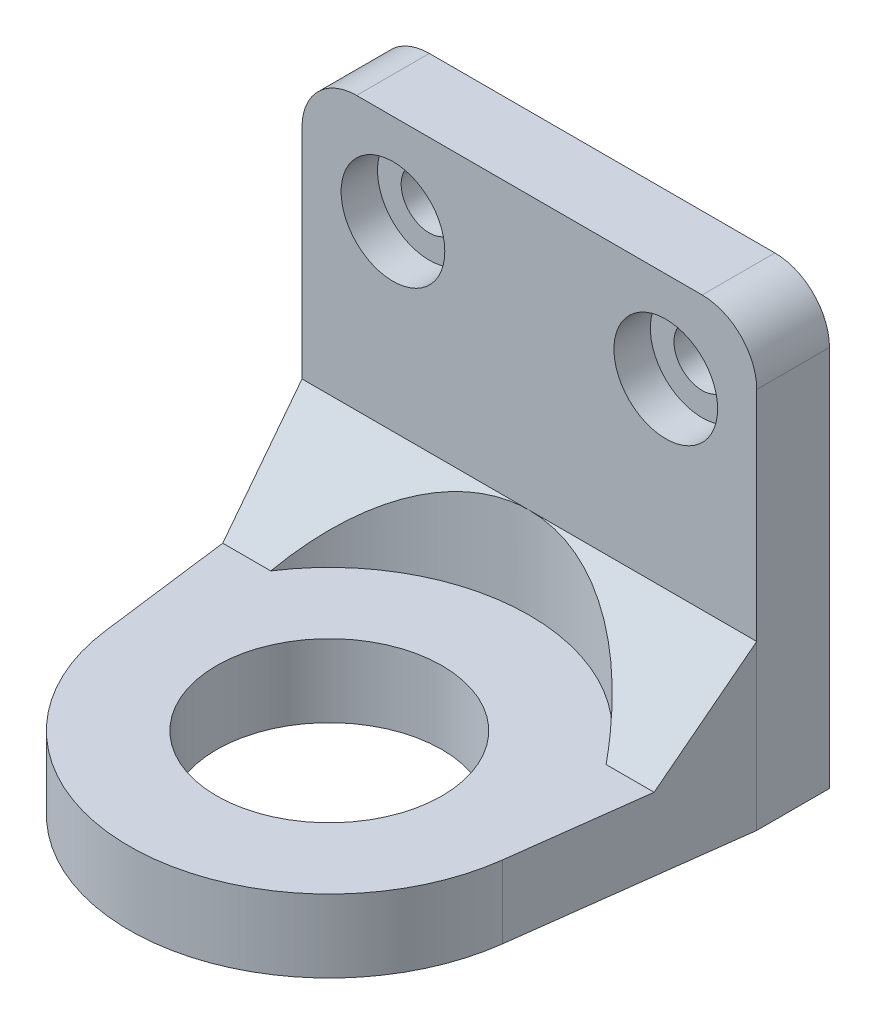
ISO-10303-21;
HEADER;
FILE_DESCRIPTION(('STEP AP214'),'2;1');
FILE_NAME('part.step','',(''),(''),'','','');
FILE_SCHEMA(('AUTOMOTIVE_DESIGN { 1 0 10303 214 1 1 1 1 }'));
ENDSEC;
DATA;
#1=APPLICATION_CONTEXT('core data for automotive mechanical design processes');
#2=APPLICATION_PROTOCOL_DEFINITION('international standard','automotive_design',2000,#1);
#3=PRODUCT_CONTEXT('',#1,'mechanical');
#4=PRODUCT('Part','Part','',(#3));
#5=PRODUCT_RELATED_PRODUCT_CATEGORY('part','',(#4));
#6=PRODUCT_DEFINITION_FORMATION('','',#4);
#7=PRODUCT_DEFINITION_CONTEXT('part definition',#1,'design');
#8=PRODUCT_DEFINITION('design','',#6,#7);
#9=PRODUCT_DEFINITION_SHAPE('','',#8);
#10=(LENGTH_UNIT() NAMED_UNIT(*) SI_UNIT(.MILLI.,.METRE.));
#11=(NAMED_UNIT(*) PLANE_ANGLE_UNIT() SI_UNIT($,.RADIAN.));
#12=(NAMED_UNIT(*) SI_UNIT($,.STERADIAN.) SOLID_ANGLE_UNIT());
#13=UNCERTAINTY_MEASURE_WITH_UNIT(LENGTH_MEASURE(1.E-05),#10,'distance_accuracy_value','');
#14=(GEOMETRIC_REPRESENTATION_CONTEXT(3) GLOBAL_UNCERTAINTY_ASSIGNED_CONTEXT((#13)) GLOBAL_UNIT_ASSIGNED_CONTEXT((#10,
#11,#12)) REPRESENTATION_CONTEXT('',''));
#15=CARTESIAN_POINT('',(0.,0.,0.));
#16=DIRECTION('',(0.,0.,1.));
#17=DIRECTION('',(1.,0.,0.));
#18=AXIS2_PLACEMENT_3D('',#15,#16,#17);
#19=CARTESIAN_POINT('',(5.,-30.5,4.));
#20=DIRECTION('',(0.,0.,-1.));
#21=DIRECTION('',(-1.,0.,0.));
#22=AXIS2_PLACEMENT_3D('',#19,#20,#21);
#23=CYLINDRICAL_SURFACE('',#22,1.55);
#24=CARTESIAN_POINT('',(5.,-30.5,0.));
#25=DIRECTION('',(0.,0.,1.));
#26=DIRECTION('',(1.,0.,0.));
#27=AXIS2_PLACEMENT_3D('',#24,#25,#26);
#28=CIRCLE('',#27,1.55);
#29=CARTESIAN_POINT('',(6.55,-30.5,0.));
#30=VERTEX_POINT('',#29);
#31=EDGE_CURVE('E234',#30,#30,#28,.T.);
#32=ORIENTED_EDGE('',*,*,#31,.F.);
#33=EDGE_LOOP('',(#32));
#34=FACE_BOUND('',#33,.T.);
#35=CARTESIAN_POINT('',(5.,-30.5,2.));
#36=DIRECTION('',(0.,0.,1.));
#37=DIRECTION('',(1.,0.,0.));
#38=AXIS2_PLACEMENT_3D('',#35,#36,#37);
#39=CIRCLE('',#38,1.55);
#40=CARTESIAN_POINT('',(6.55,-30.5,2.));
#41=VERTEX_POINT('',#40);
#42=EDGE_CURVE('E39',#41,#41,#39,.T.);
#43=ORIENTED_EDGE('',*,*,#42,.T.);
#44=EDGE_LOOP('',(#43));
#45=FACE_BOUND('',#44,.T.);
#46=ADVANCED_FACE('F35',(#34,#45),#23,.F.);
#47=CARTESIAN_POINT('',(20.,-30.5,4.));
#48=DIRECTION('',(0.,0.,-1.));
#49=DIRECTION('',(-1.,0.,0.));
#50=AXIS2_PLACEMENT_3D('',#47,#48,#49);
#51=CYLINDRICAL_SURFACE('',#50,1.55);
#52=CARTESIAN_POINT('',(20.,-30.5,0.));
#53=DIRECTION('',(0.,0.,1.));
#54=DIRECTION('',(1.,0.,0.));
#55=AXIS2_PLACEMENT_3D('',#52,#53,#54);
#56=CIRCLE('',#55,1.55);
#57=CARTESIAN_POINT('',(21.55,-30.5,0.));
#58=VERTEX_POINT('',#57);
#59=EDGE_CURVE('E225',#58,#58,#56,.T.);
#60=ORIENTED_EDGE('',*,*,#59,.F.);
#61=EDGE_LOOP('',(#60));
#62=FACE_BOUND('',#61,.T.);
#63=CARTESIAN_POINT('',(20.,-30.5,2.));
#64=DIRECTION('',(0.,0.,1.));
#65=DIRECTION('',(1.,0.,0.));
#66=AXIS2_PLACEMENT_3D('',#63,#64,#65);
#67=CIRCLE('',#66,1.55);
#68=CARTESIAN_POINT('',(21.55,-30.5,2.));
#69=VERTEX_POINT('',#68);
#70=EDGE_CURVE('E133',#69,#69,#67,.T.);
#71=ORIENTED_EDGE('',*,*,#70,.T.);
#72=EDGE_LOOP('',(#71));
#73=FACE_BOUND('',#72,.T.);
#74=ADVANCED_FACE('F290',(#62,#73),#51,.F.);
#75=CARTESIAN_POINT('',(12.5,-49.5,15.));
#76=DIRECTION('',(0.,1.,0.));
#77=DIRECTION('',(0.,0.,1.));
#78=AXIS2_PLACEMENT_3D('',#75,#76,#77);
#79=CYLINDRICAL_SURFACE('',#78,6.2);
#80=CARTESIAN_POINT('',(12.5,-49.5,15.));
#81=DIRECTION('',(0.,-1.,0.));
#82=DIRECTION('',(0.,0.,-1.));
#83=AXIS2_PLACEMENT_3D('',#80,#81,#82);
#84=CIRCLE('',#83,6.2);
#85=CARTESIAN_POINT('',(12.5,-49.5,8.8));
#86=VERTEX_POINT('',#85);
#87=EDGE_CURVE('E188',#86,#86,#84,.T.);
#88=ORIENTED_EDGE('',*,*,#87,.T.);
#89=EDGE_LOOP('',(#88));
#90=FACE_BOUND('',#89,.T.);
#91=CARTESIAN_POINT('',(12.5,-45.5,15.));
#92=DIRECTION('',(0.,-1.,0.));
#93=DIRECTION('',(0.,0.,-1.));
#94=AXIS2_PLACEMENT_3D('',#91,#92,#93);
#95=CIRCLE('',#94,6.2);
#96=CARTESIAN_POINT('',(12.5,-45.5,8.8));
#97=VERTEX_POINT('',#96);
#98=EDGE_CURVE('E132',#97,#97,#95,.T.);
#99=ORIENTED_EDGE('',*,*,#98,.F.);
#100=EDGE_LOOP('',(#99));
#101=FACE_BOUND('',#100,.T.);
#102=ADVANCED_FACE('F287',(#90,#101),#79,.F.);
#103=CARTESIAN_POINT('',(12.5,-45.5,9.00000000000009));
#104=DIRECTION('',(0.,-0.707106781186551,-0.707106781186544));
#105=DIRECTION('',(-1.,0.,0.));
#106=AXIS2_PLACEMENT_3D('',#103,#104,#105);
#107=PLANE('',#106);
#108=CARTESIAN_POINT('',(12.5,-51.4999999999999,15.));
#109=DIRECTION('',(0.,-0.707106781186551,-0.707106781186544));
#110=DIRECTION('',(0.,-0.707106781186544,0.707106781186551));
#111=AXIS2_PLACEMENT_3D('',#108,#109,#110);
#112=ELLIPSE('',#111,15.556349186104,11.);
#113=CARTESIAN_POINT('',(21.7195444572929,-45.5,9.00000000000009));
#114=VERTEX_POINT('',#113);
#115=CARTESIAN_POINT('',(12.5,-40.5,4.));
#116=VERTEX_POINT('',#115);
#117=EDGE_CURVE('E126',#114,#116,#112,.F.);
#118=ORIENTED_EDGE('',*,*,#117,.F.);
#119=DIRECTION('',(-1.,0.,0.));
#120=VECTOR('',#119,1.);
#121=CARTESIAN_POINT('',(12.5,-45.5,9.00000000000009));
#122=LINE('',#121,#120);
#123=CARTESIAN_POINT('',(24.3590909090909,-45.5,9.00000000000009));
#124=VERTEX_POINT('',#123);
#125=EDGE_CURVE('E140',#124,#114,#122,.T.);
#126=ORIENTED_EDGE('',*,*,#125,.F.);
#127=DIRECTION('',(-0.0902682015918242,-0.70422001241848,0.704220012418487));
#128=VECTOR('',#127,1.);
#129=CARTESIAN_POINT('',(24.4278819335861,-44.9633324330161,8.46333243301622));
#130=LINE('',#129,#128);
#131=CARTESIAN_POINT('',(25.,-40.5,4.));
#132=VERTEX_POINT('',#131);
#133=EDGE_CURVE('E161',#132,#124,#130,.T.);
#134=ORIENTED_EDGE('',*,*,#133,.F.);
#135=DIRECTION('',(1.,0.,0.));
#136=VECTOR('',#135,1.);
#137=CARTESIAN_POINT('',(0.,-40.5,4.));
#138=LINE('',#137,#136);
#139=EDGE_CURVE('E141',#116,#132,#138,.T.);
#140=ORIENTED_EDGE('',*,*,#139,.F.);
#141=EDGE_LOOP('',(#118,#126,#134,#140));
#142=FACE_BOUND('',#141,.T.);
#143=ADVANCED_FACE('F138',(#142),#107,.F.);
#144=CARTESIAN_POINT('',(3.28045554270705,-45.5,9.00000000000009));
#145=VERTEX_POINT('',#144);
#146=EDGE_CURVE('E128',#116,#145,#112,.F.);
#147=ORIENTED_EDGE('',*,*,#146,.F.);
#148=CARTESIAN_POINT('',(0.,-40.5,4.));
#149=VERTEX_POINT('',#148);
#150=EDGE_CURVE('E152',#149,#116,#138,.T.);
#151=ORIENTED_EDGE('',*,*,#150,.F.);
#152=DIRECTION('',(-0.0902682015918243,0.70422001241848,-0.704220012418487));
#153=VECTOR('',#152,1.);
#154=CARTESIAN_POINT('',(0.572118066413898,-44.9633324330161,8.46333243301622));
#155=LINE('',#154,#153);
#156=CARTESIAN_POINT('',(0.640909090909103,-45.5,9.00000000000009));
#157=VERTEX_POINT('',#156);
#158=EDGE_CURVE('E158',#157,#149,#155,.T.);
#159=ORIENTED_EDGE('',*,*,#158,.F.);
#160=DIRECTION('',(-1.,0.,0.));
#161=VECTOR('',#160,1.);
#162=CARTESIAN_POINT('',(12.5,-45.5,9.00000000000009));
#163=LINE('',#162,#161);
#164=EDGE_CURVE('E150',#145,#157,#163,.T.);
#165=ORIENTED_EDGE('',*,*,#164,.F.);
#166=EDGE_LOOP('',(#147,#151,#159,#165));
#167=FACE_BOUND('',#166,.T.);
#168=ADVANCED_FACE('F267',(#167),#107,.F.);
#169=CARTESIAN_POINT('',(0.,-25.5,4.));
#170=DIRECTION('',(0.,1.,0.));
#171=DIRECTION('',(0.,0.,1.));
#172=AXIS2_PLACEMENT_3D('',#169,#170,#171);
#173=PLANE('',#172);
#174=DIRECTION('',(1.,0.,0.));
#175=VECTOR('',#174,1.);
#176=CARTESIAN_POINT('',(0.,-25.5,0.));
#177=LINE('',#176,#175);
#178=CARTESIAN_POINT('',(3.,-25.5,0.));
#179=VERTEX_POINT('',#178);
#180=CARTESIAN_POINT('',(22.,-25.5,0.));
#181=VERTEX_POINT('',#180);
#182=EDGE_CURVE('E237',#179,#181,#177,.T.);
#183=ORIENTED_EDGE('',*,*,#182,.F.);
#184=DIRECTION('',(0.,0.,-1.));
#185=VECTOR('',#184,1.);
#186=CARTESIAN_POINT('',(3.,-25.5,4.));
#187=LINE('',#186,#185);
#188=CARTESIAN_POINT('',(3.,-25.5,4.));
#189=VERTEX_POINT('',#188);
#190=EDGE_CURVE('E172',#179,#189,#187,.F.);
#191=ORIENTED_EDGE('',*,*,#190,.T.);
#192=DIRECTION('',(1.,0.,0.));
#193=VECTOR('',#192,1.);
#194=CARTESIAN_POINT('',(0.,-25.5,4.));
#195=LINE('',#194,#193);
#196=CARTESIAN_POINT('',(22.,-25.5,4.));
#197=VERTEX_POINT('',#196);
#198=EDGE_CURVE('E226',#189,#197,#195,.T.);
#199=ORIENTED_EDGE('',*,*,#198,.T.);
#200=DIRECTION('',(0.,0.,-1.));
#201=VECTOR('',#200,1.);
#202=CARTESIAN_POINT('',(22.,-25.5,0.));
#203=LINE('',#202,#201);
#204=EDGE_CURVE('E169',#197,#181,#203,.T.);
#205=ORIENTED_EDGE('',*,*,#204,.T.);
#206=EDGE_LOOP('',(#183,#191,#199,#205));
#207=FACE_BOUND('',#206,.T.);
#208=ADVANCED_FACE('F250',(#207),#173,.T.);
#209=CARTESIAN_POINT('',(0.,0.,4.));
#210=DIRECTION('',(1.,0.,0.));
#211=DIRECTION('',(0.,1.,0.));
#212=AXIS2_PLACEMENT_3D('',#209,#210,#211);
#213=PLANE('',#212);
#214=DIRECTION('',(0.,-1.,0.));
#215=VECTOR('',#214,1.);
#216=CARTESIAN_POINT('',(0.,0.,4.));
#217=LINE('',#216,#215);
#218=CARTESIAN_POINT('',(0.,-28.5,4.));
#219=VERTEX_POINT('',#218);
#220=EDGE_CURVE('E228',#219,#149,#217,.T.);
#221=ORIENTED_EDGE('',*,*,#220,.F.);
#222=DIRECTION('',(0.,0.,-1.));
#223=VECTOR('',#222,1.);
#224=CARTESIAN_POINT('',(0.,-28.5,0.));
#225=LINE('',#224,#223);
#226=CARTESIAN_POINT('',(0.,-28.5,0.));
#227=VERTEX_POINT('',#226);
#228=EDGE_CURVE('E143',#219,#227,#225,.T.);
#229=ORIENTED_EDGE('',*,*,#228,.T.);
#230=DIRECTION('',(0.,-1.,0.));
#231=VECTOR('',#230,1.);
#232=CARTESIAN_POINT('',(0.,0.,0.));
#233=LINE('',#232,#231);
#234=CARTESIAN_POINT('',(0.,-49.5,0.));
#235=VERTEX_POINT('',#234);
#236=EDGE_CURVE('E240',#227,#235,#233,.T.);
#237=ORIENTED_EDGE('',*,*,#236,.T.);
#238=DIRECTION('',(0.,0.,-1.));
#239=VECTOR('',#238,1.);
#240=CARTESIAN_POINT('',(0.,-49.5,0.));
#241=LINE('',#240,#239);
#242=CARTESIAN_POINT('',(0.,-49.5,4.));
#243=VERTEX_POINT('',#242);
#244=EDGE_CURVE('E193',#243,#235,#241,.T.);
#245=ORIENTED_EDGE('',*,*,#244,.F.);
#246=DIRECTION('',(0.,1.,0.));
#247=VECTOR('',#246,1.);
#248=CARTESIAN_POINT('',(0.,-49.5,4.));
#249=LINE('',#248,#247);
#250=EDGE_CURVE('E208',#243,#149,#249,.T.);
#251=ORIENTED_EDGE('',*,*,#250,.T.);
#252=EDGE_LOOP('',(#221,#229,#237,#245,#251));
#253=FACE_BOUND('',#252,.T.);
#254=ADVANCED_FACE('F260',(#253),#213,.F.);
#255=CARTESIAN_POINT('',(25.,0.,4.));
#256=DIRECTION('',(-1.,0.,0.));
#257=DIRECTION('',(0.,0.,1.));
#258=AXIS2_PLACEMENT_3D('',#255,#256,#257);
#259=PLANE('',#258);
#260=DIRECTION('',(0.,1.,0.));
#261=VECTOR('',#260,1.);
#262=CARTESIAN_POINT('',(25.,0.,0.));
#263=LINE('',#262,#261);
#264=CARTESIAN_POINT('',(25.,-49.5,0.));
#265=VERTEX_POINT('',#264);
#266=CARTESIAN_POINT('',(25.,-28.5,0.));
#267=VERTEX_POINT('',#266);
#268=EDGE_CURVE('E229',#265,#267,#263,.T.);
#269=ORIENTED_EDGE('',*,*,#268,.T.);
#270=DIRECTION('',(0.,0.,-1.));
#271=VECTOR('',#270,1.);
#272=CARTESIAN_POINT('',(25.,-28.5,4.));
#273=LINE('',#272,#271);
#274=CARTESIAN_POINT('',(25.,-28.5,4.));
#275=VERTEX_POINT('',#274);
#276=EDGE_CURVE('E12',#267,#275,#273,.F.);
#277=ORIENTED_EDGE('',*,*,#276,.T.);
#278=DIRECTION('',(0.,1.,0.));
#279=VECTOR('',#278,1.);
#280=CARTESIAN_POINT('',(25.,0.,4.));
#281=LINE('',#280,#279);
#282=EDGE_CURVE('E154',#132,#275,#281,.T.);
#283=ORIENTED_EDGE('',*,*,#282,.F.);
#284=DIRECTION('',(0.,1.,0.));
#285=VECTOR('',#284,1.);
#286=CARTESIAN_POINT('',(25.,-49.5,4.));
#287=LINE('',#286,#285);
#288=CARTESIAN_POINT('',(25.,-49.5,4.));
#289=VERTEX_POINT('',#288);
#290=EDGE_CURVE('E222',#289,#132,#287,.T.);
#291=ORIENTED_EDGE('',*,*,#290,.F.);
#292=DIRECTION('',(0.,0.,1.));
#293=VECTOR('',#292,1.);
#294=CARTESIAN_POINT('',(25.,-49.5,4.));
#295=LINE('',#294,#293);
#296=EDGE_CURVE('E200',#265,#289,#295,.T.);
#297=ORIENTED_EDGE('',*,*,#296,.F.);
#298=EDGE_LOOP('',(#269,#277,#283,#291,#297));
#299=FACE_BOUND('',#298,.T.);
#300=ADVANCED_FACE('F242',(#299),#259,.F.);
#301=CARTESIAN_POINT('',(0.,0.,4.));
#302=DIRECTION('',(0.,0.,1.));
#303=DIRECTION('',(1.,0.,0.));
#304=AXIS2_PLACEMENT_3D('',#301,#302,#303);
#305=PLANE('',#304);
#306=CARTESIAN_POINT('',(5.,-30.5,4.));
#307=DIRECTION('',(0.,0.,1.));
#308=DIRECTION('',(1.,0.,0.));
#309=AXIS2_PLACEMENT_3D('',#306,#307,#308);
#310=CIRCLE('',#309,2.85);
#311=CARTESIAN_POINT('',(7.85,-30.5,4.));
#312=VERTEX_POINT('',#311);
#313=EDGE_CURVE('E349',#312,#312,#310,.T.);
#314=ORIENTED_EDGE('',*,*,#313,.F.);
#315=EDGE_LOOP('',(#314));
#316=FACE_BOUND('',#315,.T.);
#317=CARTESIAN_POINT('',(20.,-30.5,4.));
#318=DIRECTION('',(0.,0.,1.));
#319=DIRECTION('',(1.,0.,0.));
#320=AXIS2_PLACEMENT_3D('',#317,#318,#319);
#321=CIRCLE('',#320,2.85);
#322=CARTESIAN_POINT('',(22.85,-30.5,4.));
#323=VERTEX_POINT('',#322);
#324=EDGE_CURVE('E180',#323,#323,#321,.T.);
#325=ORIENTED_EDGE('',*,*,#324,.F.);
#326=EDGE_LOOP('',(#325));
#327=FACE_BOUND('',#326,.T.);
#328=ORIENTED_EDGE('',*,*,#198,.F.);
#329=CARTESIAN_POINT('',(3.,-28.5,4.));
#330=DIRECTION('',(0.,0.,1.));
#331=DIRECTION('',(1.,0.,0.));
#332=AXIS2_PLACEMENT_3D('',#329,#330,#331);
#333=CIRCLE('',#332,3.);
#334=EDGE_CURVE('E44',#189,#219,#333,.T.);
#335=ORIENTED_EDGE('',*,*,#334,.T.);
#336=ORIENTED_EDGE('',*,*,#220,.T.);
#337=ORIENTED_EDGE('',*,*,#150,.T.);
#338=ORIENTED_EDGE('',*,*,#139,.T.);
#339=ORIENTED_EDGE('',*,*,#282,.T.);
#340=CARTESIAN_POINT('',(22.,-28.5,4.));
#341=DIRECTION('',(0.,0.,1.));
#342=DIRECTION('',(1.,0.,0.));
#343=AXIS2_PLACEMENT_3D('',#340,#341,#342);
#344=CIRCLE('',#343,3.);
#345=EDGE_CURVE('E57',#275,#197,#344,.T.);
#346=ORIENTED_EDGE('',*,*,#345,.T.);
#347=EDGE_LOOP('',(#328,#335,#336,#337,#338,#339,#346));
#348=FACE_BOUND('',#347,.T.);
#349=ADVANCED_FACE('F263',(#316,#327,#348),#305,.T.);
#350=CARTESIAN_POINT('',(0.,0.,0.));
#351=DIRECTION('',(0.,0.,1.));
#352=DIRECTION('',(1.,0.,0.));
#353=AXIS2_PLACEMENT_3D('',#350,#351,#352);
#354=PLANE('',#353);
#355=ORIENTED_EDGE('',*,*,#59,.T.);
#356=EDGE_LOOP('',(#355));
#357=FACE_BOUND('',#356,.T.);
#358=ORIENTED_EDGE('',*,*,#31,.T.);
#359=EDGE_LOOP('',(#358));
#360=FACE_BOUND('',#359,.T.);
#361=ORIENTED_EDGE('',*,*,#236,.F.);
#362=CARTESIAN_POINT('',(3.,-28.5,0.));
#363=DIRECTION('',(0.,0.,1.));
#364=DIRECTION('',(1.,0.,0.));
#365=AXIS2_PLACEMENT_3D('',#362,#363,#364);
#366=CIRCLE('',#365,3.);
#367=EDGE_CURVE('E167',#227,#179,#366,.F.);
#368=ORIENTED_EDGE('',*,*,#367,.T.);
#369=ORIENTED_EDGE('',*,*,#182,.T.);
#370=CARTESIAN_POINT('',(22.,-28.5,0.));
#371=DIRECTION('',(0.,0.,1.));
#372=DIRECTION('',(1.,0.,0.));
#373=AXIS2_PLACEMENT_3D('',#370,#371,#372);
#374=CIRCLE('',#373,3.);
#375=EDGE_CURVE('E165',#181,#267,#374,.F.);
#376=ORIENTED_EDGE('',*,*,#375,.T.);
#377=ORIENTED_EDGE('',*,*,#268,.F.);
#378=DIRECTION('',(1.,0.,0.));
#379=VECTOR('',#378,1.);
#380=CARTESIAN_POINT('',(25.,-49.5,0.));
#381=LINE('',#380,#379);
#382=EDGE_CURVE('E196',#235,#265,#381,.T.);
#383=ORIENTED_EDGE('',*,*,#382,.F.);
#384=EDGE_LOOP('',(#361,#368,#369,#376,#377,#383));
#385=FACE_BOUND('',#384,.T.);
#386=ADVANCED_FACE('F253',(#357,#360,#385),#354,.F.);
#387=CARTESIAN_POINT('',(12.5,-45.5,15.));
#388=DIRECTION('',(0.,-1.,0.));
#389=DIRECTION('',(0.,0.,-1.));
#390=AXIS2_PLACEMENT_3D('',#387,#388,#389);
#391=PLANE('',#390);
#392=CARTESIAN_POINT('',(12.5,-45.5,15.));
#393=DIRECTION('',(0.,1.,0.));
#394=DIRECTION('',(0.,0.,1.));
#395=AXIS2_PLACEMENT_3D('',#392,#393,#394);
#396=CIRCLE('',#395,11.);
#397=EDGE_CURVE('E123',#114,#145,#396,.T.);
#398=ORIENTED_EDGE('',*,*,#397,.T.);
#399=ORIENTED_EDGE('',*,*,#164,.T.);
#400=DIRECTION('',(-0.127141568981064,0.,-0.991884580703336));
#401=VECTOR('',#400,1.);
#402=CARTESIAN_POINT('',(0.,-45.5,4.));
#403=LINE('',#402,#401);
#404=CARTESIAN_POINT('',(1.5892696122633,-45.5,16.3985572587917));
#405=VERTEX_POINT('',#404);
#406=EDGE_CURVE('E197',#405,#157,#403,.T.);
#407=ORIENTED_EDGE('',*,*,#406,.F.);
#408=CARTESIAN_POINT('',(12.5,-45.5,15.));
#409=DIRECTION('',(0.,-1.,0.));
#410=DIRECTION('',(0.,0.,-1.));
#411=AXIS2_PLACEMENT_3D('',#408,#409,#410);
#412=CIRCLE('',#411,11.);
#413=CARTESIAN_POINT('',(23.4107303877367,-45.5,16.3985572587917));
#414=VERTEX_POINT('',#413);
#415=EDGE_CURVE('E210',#414,#405,#412,.T.);
#416=ORIENTED_EDGE('',*,*,#415,.F.);
#417=DIRECTION('',(-0.127141568981064,0.,0.991884580703336));
#418=VECTOR('',#417,1.);
#419=CARTESIAN_POINT('',(25.,-45.5,4.));
#420=LINE('',#419,#418);
#421=EDGE_CURVE('E149',#124,#414,#420,.T.);
#422=ORIENTED_EDGE('',*,*,#421,.F.);
#423=ORIENTED_EDGE('',*,*,#125,.T.);
#424=EDGE_LOOP('',(#398,#399,#407,#416,#422,#423));
#425=FACE_BOUND('',#424,.T.);
#426=ORIENTED_EDGE('',*,*,#98,.T.);
#427=EDGE_LOOP('',(#426));
#428=FACE_BOUND('',#427,.T.);
#429=ADVANCED_FACE('F146',(#425,#428),#391,.F.);
#430=CARTESIAN_POINT('',(12.5,-49.5,15.));
#431=DIRECTION('',(0.,-1.,0.));
#432=DIRECTION('',(0.,0.,-1.));
#433=AXIS2_PLACEMENT_3D('',#430,#431,#432);
#434=PLANE('',#433);
#435=ORIENTED_EDGE('',*,*,#244,.T.);
#436=ORIENTED_EDGE('',*,*,#382,.T.);
#437=ORIENTED_EDGE('',*,*,#296,.T.);
#438=DIRECTION('',(-0.127141568981064,0.,0.991884580703336));
#439=VECTOR('',#438,1.);
#440=CARTESIAN_POINT('',(25.,-49.5,4.));
#441=LINE('',#440,#439);
#442=CARTESIAN_POINT('',(23.4107303877367,-49.5,16.3985572587917));
#443=VERTEX_POINT('',#442);
#444=EDGE_CURVE('E202',#289,#443,#441,.T.);
#445=ORIENTED_EDGE('',*,*,#444,.T.);
#446=CARTESIAN_POINT('',(12.5,-49.5,15.));
#447=DIRECTION('',(0.,-1.,0.));
#448=DIRECTION('',(0.,0.,-1.));
#449=AXIS2_PLACEMENT_3D('',#446,#447,#448);
#450=CIRCLE('',#449,11.);
#451=CARTESIAN_POINT('',(1.5892696122633,-49.5,16.3985572587917));
#452=VERTEX_POINT('',#451);
#453=EDGE_CURVE('E204',#443,#452,#450,.T.);
#454=ORIENTED_EDGE('',*,*,#453,.T.);
#455=DIRECTION('',(-0.127141568981064,0.,-0.991884580703336));
#456=VECTOR('',#455,1.);
#457=CARTESIAN_POINT('',(0.,-49.5,4.));
#458=LINE('',#457,#456);
#459=EDGE_CURVE('E206',#452,#243,#458,.T.);
#460=ORIENTED_EDGE('',*,*,#459,.T.);
#461=EDGE_LOOP('',(#435,#436,#437,#445,#454,#460));
#462=FACE_BOUND('',#461,.T.);
#463=ORIENTED_EDGE('',*,*,#87,.F.);
#464=EDGE_LOOP('',(#463));
#465=FACE_BOUND('',#464,.T.);
#466=ADVANCED_FACE('F281',(#462,#465),#434,.T.);
#467=CARTESIAN_POINT('',(25.,-49.5,4.));
#468=DIRECTION('',(-0.991884580703336,0.,-0.127141568981064));
#469=DIRECTION('',(-0.127141568981064,0.,0.991884580703337));
#470=AXIS2_PLACEMENT_3D('',#467,#468,#469);
#471=PLANE('',#470);
#472=ORIENTED_EDGE('',*,*,#290,.T.);
#473=ORIENTED_EDGE('',*,*,#133,.T.);
#474=ORIENTED_EDGE('',*,*,#421,.T.);
#475=DIRECTION('',(0.,1.,0.));
#476=VECTOR('',#475,1.);
#477=CARTESIAN_POINT('',(23.4107303877367,-49.5,16.3985572587917));
#478=LINE('',#477,#476);
#479=EDGE_CURVE('E219',#443,#414,#478,.T.);
#480=ORIENTED_EDGE('',*,*,#479,.F.);
#481=ORIENTED_EDGE('',*,*,#444,.F.);
#482=EDGE_LOOP('',(#472,#473,#474,#480,#481));
#483=FACE_BOUND('',#482,.T.);
#484=ADVANCED_FACE('F279',(#483),#471,.F.);
#485=CARTESIAN_POINT('',(12.5,-49.5,15.));
#486=DIRECTION('',(0.,1.,0.));
#487=DIRECTION('',(0.,0.,1.));
#488=AXIS2_PLACEMENT_3D('',#485,#486,#487);
#489=CYLINDRICAL_SURFACE('',#488,11.);
#490=ORIENTED_EDGE('',*,*,#415,.T.);
#491=DIRECTION('',(0.,1.,0.));
#492=VECTOR('',#491,1.);
#493=CARTESIAN_POINT('',(1.5892696122633,-49.5,16.3985572587917));
#494=LINE('',#493,#492);
#495=EDGE_CURVE('E216',#452,#405,#494,.T.);
#496=ORIENTED_EDGE('',*,*,#495,.F.);
#497=ORIENTED_EDGE('',*,*,#453,.F.);
#498=ORIENTED_EDGE('',*,*,#479,.T.);
#499=EDGE_LOOP('',(#490,#496,#497,#498));
#500=FACE_BOUND('',#499,.T.);
#501=ADVANCED_FACE('F275',(#500),#489,.T.);
#502=CARTESIAN_POINT('',(0.,-49.5,4.));
#503=DIRECTION('',(0.991884580703336,0.,-0.127141568981064));
#504=DIRECTION('',(-0.127141568981064,0.,-0.991884580703336));
#505=AXIS2_PLACEMENT_3D('',#502,#503,#504);
#506=PLANE('',#505);
#507=ORIENTED_EDGE('',*,*,#406,.T.);
#508=ORIENTED_EDGE('',*,*,#158,.T.);
#509=ORIENTED_EDGE('',*,*,#250,.F.);
#510=ORIENTED_EDGE('',*,*,#459,.F.);
#511=ORIENTED_EDGE('',*,*,#495,.T.);
#512=EDGE_LOOP('',(#507,#508,#509,#510,#511));
#513=FACE_BOUND('',#512,.T.);
#514=ADVANCED_FACE('F270',(#513),#506,.F.);
#515=CARTESIAN_POINT('',(12.5,-35.5,15.));
#516=DIRECTION('',(0.,-1.,0.));
#517=DIRECTION('',(0.,0.,-1.));
#518=AXIS2_PLACEMENT_3D('',#515,#516,#517);
#519=CYLINDRICAL_SURFACE('',#518,11.);
#520=ORIENTED_EDGE('',*,*,#117,.T.);
#521=ORIENTED_EDGE('',*,*,#146,.T.);
#522=ORIENTED_EDGE('',*,*,#397,.F.);
#523=EDGE_LOOP('',(#520,#521,#522));
#524=FACE_BOUND('',#523,.T.);
#525=ADVANCED_FACE('F125',(#524),#519,.F.);
#526=CARTESIAN_POINT('',(3.,-28.5,4.));
#527=DIRECTION('',(0.,0.,1.));
#528=DIRECTION('',(1.,0.,0.));
#529=AXIS2_PLACEMENT_3D('',#526,#527,#528);
#530=CYLINDRICAL_SURFACE('',#529,3.);
#531=ORIENTED_EDGE('',*,*,#334,.F.);
#532=ORIENTED_EDGE('',*,*,#190,.F.);
#533=ORIENTED_EDGE('',*,*,#367,.F.);
#534=ORIENTED_EDGE('',*,*,#228,.F.);
#535=EDGE_LOOP('',(#531,#532,#533,#534));
#536=FACE_BOUND('',#535,.T.);
#537=ADVANCED_FACE('F257',(#536),#530,.T.);
#538=CARTESIAN_POINT('',(22.,-28.5,4.));
#539=DIRECTION('',(0.,0.,1.));
#540=DIRECTION('',(1.,0.,0.));
#541=AXIS2_PLACEMENT_3D('',#538,#539,#540);
#542=CYLINDRICAL_SURFACE('',#541,3.);
#543=ORIENTED_EDGE('',*,*,#345,.F.);
#544=ORIENTED_EDGE('',*,*,#276,.F.);
#545=ORIENTED_EDGE('',*,*,#375,.F.);
#546=ORIENTED_EDGE('',*,*,#204,.F.);
#547=EDGE_LOOP('',(#543,#544,#545,#546));
#548=FACE_BOUND('',#547,.T.);
#549=ADVANCED_FACE('F37',(#548),#542,.T.);
#550=CARTESIAN_POINT('',(20.,-30.5,-8.06101730552665));
#551=DIRECTION('',(0.,0.,1.));
#552=DIRECTION('',(1.,0.,0.));
#553=AXIS2_PLACEMENT_3D('',#550,#551,#552);
#554=CYLINDRICAL_SURFACE('',#553,2.85);
#555=CARTESIAN_POINT('',(20.,-30.5,2.));
#556=DIRECTION('',(0.,0.,1.));
#557=DIRECTION('',(1.,0.,0.));
#558=AXIS2_PLACEMENT_3D('',#555,#556,#557);
#559=CIRCLE('',#558,2.85);
#560=CARTESIAN_POINT('',(22.85,-30.5,2.));
#561=VERTEX_POINT('',#560);
#562=EDGE_CURVE('E176',#561,#561,#559,.F.);
#563=ORIENTED_EDGE('',*,*,#562,.T.);
#564=EDGE_LOOP('',(#563));
#565=FACE_BOUND('',#564,.T.);
#566=ORIENTED_EDGE('',*,*,#324,.T.);
#567=EDGE_LOOP('',(#566));
#568=FACE_BOUND('',#567,.T.);
#569=ADVANCED_FACE('F322',(#565,#568),#554,.F.);
#570=CARTESIAN_POINT('',(0.,0.,2.));
#571=DIRECTION('',(0.,0.,1.));
#572=DIRECTION('',(1.,0.,0.));
#573=AXIS2_PLACEMENT_3D('',#570,#571,#572);
#574=PLANE('',#573);
#575=ORIENTED_EDGE('',*,*,#70,.F.);
#576=EDGE_LOOP('',(#575));
#577=FACE_BOUND('',#576,.T.);
#578=ORIENTED_EDGE('',*,*,#562,.F.);
#579=EDGE_LOOP('',(#578));
#580=FACE_BOUND('',#579,.T.);
#581=ADVANCED_FACE('F330',(#577,#580),#574,.T.);
#582=CARTESIAN_POINT('',(5.,-30.5,-8.06101730552665));
#583=DIRECTION('',(0.,0.,1.));
#584=DIRECTION('',(1.,0.,0.));
#585=AXIS2_PLACEMENT_3D('',#582,#583,#584);
#586=CYLINDRICAL_SURFACE('',#585,2.85);
#587=CARTESIAN_POINT('',(5.,-30.5,2.));
#588=DIRECTION('',(0.,0.,1.));
#589=DIRECTION('',(1.,0.,0.));
#590=AXIS2_PLACEMENT_3D('',#587,#588,#589);
#591=CIRCLE('',#590,2.85);
#592=CARTESIAN_POINT('',(7.85,-30.5,2.));
#593=VERTEX_POINT('',#592);
#594=EDGE_CURVE('E348',#593,#593,#591,.F.);
#595=ORIENTED_EDGE('',*,*,#594,.T.);
#596=EDGE_LOOP('',(#595));
#597=FACE_BOUND('',#596,.T.);
#598=ORIENTED_EDGE('',*,*,#313,.T.);
#599=EDGE_LOOP('',(#598));
#600=FACE_BOUND('',#599,.T.);
#601=ADVANCED_FACE('F333',(#597,#600),#586,.F.);
#602=CARTESIAN_POINT('',(0.,0.,2.));
#603=DIRECTION('',(0.,0.,1.));
#604=DIRECTION('',(1.,0.,0.));
#605=AXIS2_PLACEMENT_3D('',#602,#603,#604);
#606=PLANE('',#605);
#607=ORIENTED_EDGE('',*,*,#42,.F.);
#608=EDGE_LOOP('',(#607));
#609=FACE_BOUND('',#608,.T.);
#610=ORIENTED_EDGE('',*,*,#594,.F.);
#611=EDGE_LOOP('',(#610));
#612=FACE_BOUND('',#611,.T.);
#613=ADVANCED_FACE('F337',(#609,#612),#606,.T.);
#614=CLOSED_SHELL('',(#46,#74,#102,#143,#168,#208,#254,#300,#349,#386,#429,#466,#484,#501,#514,
#525,#537,#549,#569,#581,#601,#613));
#615=MANIFOLD_SOLID_BREP('B2',#614);
#616=ADVANCED_BREP_SHAPE_REPRESENTATION('',(#18,#615),#14);
#617=SHAPE_DEFINITION_REPRESENTATION(#9,#616);
ENDSEC;
END-ISO-10303-21;
